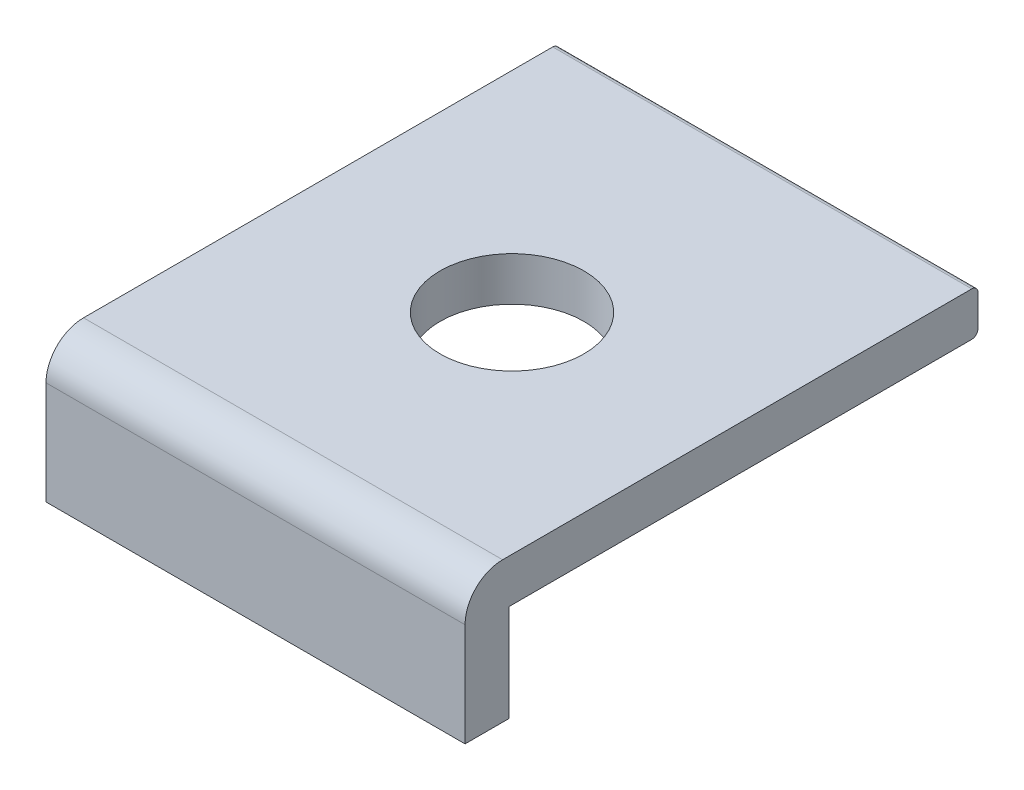
ISO-10303-21;
HEADER;
FILE_DESCRIPTION(('STEP AP214'),'2;1');
FILE_NAME('part.step','',(''),(''),'','','');
FILE_SCHEMA(('AUTOMOTIVE_DESIGN { 1 0 10303 214 1 1 1 1 }'));
ENDSEC;
DATA;
#1=APPLICATION_CONTEXT('core data for automotive mechanical design processes');
#2=APPLICATION_PROTOCOL_DEFINITION('international standard','automotive_design',2000,#1);
#3=PRODUCT_CONTEXT('',#1,'mechanical');
#4=PRODUCT('Part','Part','',(#3));
#5=PRODUCT_RELATED_PRODUCT_CATEGORY('part','',(#4));
#6=PRODUCT_DEFINITION_FORMATION('','',#4);
#7=PRODUCT_DEFINITION_CONTEXT('part definition',#1,'design');
#8=PRODUCT_DEFINITION('design','',#6,#7);
#9=PRODUCT_DEFINITION_SHAPE('','',#8);
#10=(LENGTH_UNIT() NAMED_UNIT(*) SI_UNIT(.MILLI.,.METRE.));
#11=(NAMED_UNIT(*) PLANE_ANGLE_UNIT() SI_UNIT($,.RADIAN.));
#12=(NAMED_UNIT(*) SI_UNIT($,.STERADIAN.) SOLID_ANGLE_UNIT());
#13=UNCERTAINTY_MEASURE_WITH_UNIT(LENGTH_MEASURE(1.E-05),#10,'distance_accuracy_value','');
#14=(GEOMETRIC_REPRESENTATION_CONTEXT(3) GLOBAL_UNCERTAINTY_ASSIGNED_CONTEXT((#13)) GLOBAL_UNIT_ASSIGNED_CONTEXT((#10,
#11,#12)) REPRESENTATION_CONTEXT('',''));
#15=CARTESIAN_POINT('',(0.,0.,0.));
#16=DIRECTION('',(0.,0.,1.));
#17=DIRECTION('',(1.,0.,0.));
#18=AXIS2_PLACEMENT_3D('',#15,#16,#17);
#19=CARTESIAN_POINT('',(6.7,0.,0.));
#20=DIRECTION('',(0.,1.,0.));
#21=DIRECTION('',(0.,0.,1.));
#22=AXIS2_PLACEMENT_3D('',#19,#20,#21);
#23=PLANE('',#22);
#24=DIRECTION('',(0.,0.,-1.));
#25=VECTOR('',#24,1.);
#26=CARTESIAN_POINT('',(0.,0.,0.));
#27=LINE('',#26,#25);
#28=CARTESIAN_POINT('',(0.,0.,0.));
#29=VERTEX_POINT('',#28);
#30=CARTESIAN_POINT('',(0.,0.,-0.7));
#31=VERTEX_POINT('',#30);
#32=EDGE_CURVE('E136',#29,#31,#27,.T.);
#33=ORIENTED_EDGE('',*,*,#32,.T.);
#34=DIRECTION('',(-1.,0.,0.));
#35=VECTOR('',#34,1.);
#36=CARTESIAN_POINT('',(6.7,0.,-0.7));
#37=LINE('',#36,#35);
#38=CARTESIAN_POINT('',(6.7,0.,-0.7));
#39=VERTEX_POINT('',#38);
#40=EDGE_CURVE('E11',#39,#31,#37,.T.);
#41=ORIENTED_EDGE('',*,*,#40,.F.);
#42=DIRECTION('',(0.,0.,-1.));
#43=VECTOR('',#42,1.);
#44=CARTESIAN_POINT('',(6.7,0.,0.));
#45=LINE('',#44,#43);
#46=CARTESIAN_POINT('',(6.7,0.,0.));
#47=VERTEX_POINT('',#46);
#48=EDGE_CURVE('E153',#47,#39,#45,.T.);
#49=ORIENTED_EDGE('',*,*,#48,.F.);
#50=DIRECTION('',(-1.,0.,0.));
#51=VECTOR('',#50,1.);
#52=CARTESIAN_POINT('',(6.7,0.,0.));
#53=LINE('',#52,#51);
#54=EDGE_CURVE('E132',#47,#29,#53,.T.);
#55=ORIENTED_EDGE('',*,*,#54,.T.);
#56=EDGE_LOOP('',(#33,#41,#49,#55));
#57=FACE_BOUND('',#56,.T.);
#58=ADVANCED_FACE('F34',(#57),#23,.F.);
#59=CARTESIAN_POINT('',(6.7,0.,-0.7));
#60=DIRECTION('',(0.,0.,1.));
#61=DIRECTION('',(1.,0.,0.));
#62=AXIS2_PLACEMENT_3D('',#59,#60,#61);
#63=PLANE('',#62);
#64=DIRECTION('',(0.,1.,0.));
#65=VECTOR('',#64,1.);
#66=CARTESIAN_POINT('',(0.,0.,-0.7));
#67=LINE('',#66,#65);
#68=CARTESIAN_POINT('',(0.,1.55,-0.7));
#69=VERTEX_POINT('',#68);
#70=EDGE_CURVE('E139',#31,#69,#67,.T.);
#71=ORIENTED_EDGE('',*,*,#70,.T.);
#72=DIRECTION('',(-1.,0.,0.));
#73=VECTOR('',#72,1.);
#74=CARTESIAN_POINT('',(6.7,1.55,-0.7));
#75=LINE('',#74,#73);
#76=CARTESIAN_POINT('',(6.7,1.55,-0.7));
#77=VERTEX_POINT('',#76);
#78=EDGE_CURVE('E42',#77,#69,#75,.T.);
#79=ORIENTED_EDGE('',*,*,#78,.F.);
#80=DIRECTION('',(0.,1.,0.));
#81=VECTOR('',#80,1.);
#82=CARTESIAN_POINT('',(6.7,0.,-0.7));
#83=LINE('',#82,#81);
#84=EDGE_CURVE('E96',#39,#77,#83,.T.);
#85=ORIENTED_EDGE('',*,*,#84,.F.);
#86=ORIENTED_EDGE('',*,*,#40,.T.);
#87=EDGE_LOOP('',(#71,#79,#85,#86));
#88=FACE_BOUND('',#87,.T.);
#89=ADVANCED_FACE('F215',(#88),#63,.F.);
#90=CARTESIAN_POINT('',(6.7,1.55,-0.7));
#91=DIRECTION('',(0.,1.,0.));
#92=DIRECTION('',(0.,0.,1.));
#93=AXIS2_PLACEMENT_3D('',#90,#91,#92);
#94=PLANE('',#93);
#95=CARTESIAN_POINT('',(3.35,1.55,-4.1005));
#96=DIRECTION('',(0.,1.,0.));
#97=DIRECTION('',(0.,0.,1.));
#98=AXIS2_PLACEMENT_3D('',#95,#96,#97);
#99=CIRCLE('',#98,1.15);
#100=CARTESIAN_POINT('',(3.35,1.55,-2.9505));
#101=VERTEX_POINT('',#100);
#102=EDGE_CURVE('E140',#101,#101,#99,.T.);
#103=ORIENTED_EDGE('',*,*,#102,.T.);
#104=EDGE_LOOP('',(#103));
#105=FACE_BOUND('',#104,.T.);
#106=DIRECTION('',(0.,0.,-1.));
#107=VECTOR('',#106,1.);
#108=CARTESIAN_POINT('',(0.,1.55,-0.7));
#109=LINE('',#108,#107);
#110=CARTESIAN_POINT('',(0.,1.55,-8.101));
#111=VERTEX_POINT('',#110);
#112=EDGE_CURVE('E142',#69,#111,#109,.T.);
#113=ORIENTED_EDGE('',*,*,#112,.T.);
#114=DIRECTION('',(-1.,0.,0.));
#115=VECTOR('',#114,1.);
#116=CARTESIAN_POINT('',(6.7,1.55,-8.101));
#117=LINE('',#116,#115);
#118=CARTESIAN_POINT('',(6.7,1.55,-8.101));
#119=VERTEX_POINT('',#118);
#120=EDGE_CURVE('E163',#119,#111,#117,.T.);
#121=ORIENTED_EDGE('',*,*,#120,.F.);
#122=DIRECTION('',(0.,0.,-1.));
#123=VECTOR('',#122,1.);
#124=CARTESIAN_POINT('',(6.7,1.55,-0.7));
#125=LINE('',#124,#123);
#126=EDGE_CURVE('E171',#77,#119,#125,.T.);
#127=ORIENTED_EDGE('',*,*,#126,.F.);
#128=ORIENTED_EDGE('',*,*,#78,.T.);
#129=EDGE_LOOP('',(#113,#121,#127,#128));
#130=FACE_BOUND('',#129,.T.);
#131=ADVANCED_FACE('F169',(#105,#130),#94,.F.);
#132=CARTESIAN_POINT('',(6.7,1.65,-8.101));
#133=DIRECTION('',(-1.,0.,0.));
#134=DIRECTION('',(0.,0.,1.));
#135=AXIS2_PLACEMENT_3D('',#132,#133,#134);
#136=CYLINDRICAL_SURFACE('',#135,0.0999999999999997);
#137=CARTESIAN_POINT('',(0.,1.65,-8.101));
#138=DIRECTION('',(1.,0.,0.));
#139=DIRECTION('',(0.,0.,1.));
#140=AXIS2_PLACEMENT_3D('',#137,#138,#139);
#141=CIRCLE('',#140,0.0999999999999997);
#142=CARTESIAN_POINT('',(0.,1.65,-8.201));
#143=VERTEX_POINT('',#142);
#144=EDGE_CURVE('E144',#111,#143,#141,.T.);
#145=ORIENTED_EDGE('',*,*,#144,.T.);
#146=DIRECTION('',(-1.,0.,0.));
#147=VECTOR('',#146,1.);
#148=CARTESIAN_POINT('',(6.7,1.65,-8.201));
#149=LINE('',#148,#147);
#150=CARTESIAN_POINT('',(6.7,1.65,-8.201));
#151=VERTEX_POINT('',#150);
#152=EDGE_CURVE('E160',#151,#143,#149,.T.);
#153=ORIENTED_EDGE('',*,*,#152,.F.);
#154=CARTESIAN_POINT('',(6.7,1.65,-8.101));
#155=DIRECTION('',(1.,0.,0.));
#156=DIRECTION('',(0.,0.,1.));
#157=AXIS2_PLACEMENT_3D('',#154,#155,#156);
#158=CIRCLE('',#157,0.0999999999999997);
#159=EDGE_CURVE('E187',#119,#151,#158,.T.);
#160=ORIENTED_EDGE('',*,*,#159,.F.);
#161=ORIENTED_EDGE('',*,*,#120,.T.);
#162=EDGE_LOOP('',(#145,#153,#160,#161));
#163=FACE_BOUND('',#162,.T.);
#164=ADVANCED_FACE('F180',(#163),#136,.T.);
#165=CARTESIAN_POINT('',(6.7,2.15,-8.201));
#166=DIRECTION('',(0.,0.,1.));
#167=DIRECTION('',(1.,0.,0.));
#168=AXIS2_PLACEMENT_3D('',#165,#166,#167);
#169=PLANE('',#168);
#170=DIRECTION('',(0.,1.,0.));
#171=VECTOR('',#170,1.);
#172=CARTESIAN_POINT('',(0.,2.15,-8.201));
#173=LINE('',#172,#171);
#174=CARTESIAN_POINT('',(0.,2.15,-8.201));
#175=VERTEX_POINT('',#174);
#176=EDGE_CURVE('E146',#143,#175,#173,.T.);
#177=ORIENTED_EDGE('',*,*,#176,.T.);
#178=DIRECTION('',(-1.,0.,0.));
#179=VECTOR('',#178,1.);
#180=CARTESIAN_POINT('',(6.7,2.15,-8.201));
#181=LINE('',#180,#179);
#182=CARTESIAN_POINT('',(6.7,2.15,-8.201));
#183=VERTEX_POINT('',#182);
#184=EDGE_CURVE('E157',#183,#175,#181,.T.);
#185=ORIENTED_EDGE('',*,*,#184,.F.);
#186=DIRECTION('',(0.,1.,0.));
#187=VECTOR('',#186,1.);
#188=CARTESIAN_POINT('',(6.7,2.15,-8.201));
#189=LINE('',#188,#187);
#190=EDGE_CURVE('E186',#151,#183,#189,.T.);
#191=ORIENTED_EDGE('',*,*,#190,.F.);
#192=ORIENTED_EDGE('',*,*,#152,.T.);
#193=EDGE_LOOP('',(#177,#185,#191,#192));
#194=FACE_BOUND('',#193,.T.);
#195=ADVANCED_FACE('F184',(#194),#169,.F.);
#196=CARTESIAN_POINT('',(6.7,2.15,-8.101));
#197=DIRECTION('',(-1.,0.,0.));
#198=DIRECTION('',(0.,0.,1.));
#199=AXIS2_PLACEMENT_3D('',#196,#197,#198);
#200=CYLINDRICAL_SURFACE('',#199,0.0999999999999996);
#201=CARTESIAN_POINT('',(0.,2.15,-8.101));
#202=DIRECTION('',(1.,0.,0.));
#203=DIRECTION('',(0.,0.,-1.));
#204=AXIS2_PLACEMENT_3D('',#201,#202,#203);
#205=CIRCLE('',#204,0.0999999999999996);
#206=CARTESIAN_POINT('',(0.,2.25,-8.101));
#207=VERTEX_POINT('',#206);
#208=EDGE_CURVE('E148',#175,#207,#205,.T.);
#209=ORIENTED_EDGE('',*,*,#208,.T.);
#210=DIRECTION('',(-1.,0.,0.));
#211=VECTOR('',#210,1.);
#212=CARTESIAN_POINT('',(6.7,2.25,-8.101));
#213=LINE('',#212,#211);
#214=CARTESIAN_POINT('',(6.7,2.25,-8.101));
#215=VERTEX_POINT('',#214);
#216=EDGE_CURVE('E127',#215,#207,#213,.T.);
#217=ORIENTED_EDGE('',*,*,#216,.F.);
#218=CARTESIAN_POINT('',(6.7,2.15,-8.101));
#219=DIRECTION('',(1.,0.,0.));
#220=DIRECTION('',(0.,0.,-1.));
#221=AXIS2_PLACEMENT_3D('',#218,#219,#220);
#222=CIRCLE('',#221,0.0999999999999996);
#223=EDGE_CURVE('E118',#183,#215,#222,.T.);
#224=ORIENTED_EDGE('',*,*,#223,.F.);
#225=ORIENTED_EDGE('',*,*,#184,.T.);
#226=EDGE_LOOP('',(#209,#217,#224,#225));
#227=FACE_BOUND('',#226,.T.);
#228=ADVANCED_FACE('F204',(#227),#200,.T.);
#229=CARTESIAN_POINT('',(6.7,2.25,-0.600000000000004));
#230=DIRECTION('',(0.,-1.,0.));
#231=DIRECTION('',(0.,0.,-1.));
#232=AXIS2_PLACEMENT_3D('',#229,#230,#231);
#233=PLANE('',#232);
#234=CARTESIAN_POINT('',(3.35,2.25,-4.1005));
#235=DIRECTION('',(0.,1.,0.));
#236=DIRECTION('',(0.,0.,1.));
#237=AXIS2_PLACEMENT_3D('',#234,#235,#236);
#238=CIRCLE('',#237,1.15);
#239=CARTESIAN_POINT('',(3.35,2.25,-2.9505));
#240=VERTEX_POINT('',#239);
#241=EDGE_CURVE('E196',#240,#240,#238,.T.);
#242=ORIENTED_EDGE('',*,*,#241,.F.);
#243=EDGE_LOOP('',(#242));
#244=FACE_BOUND('',#243,.T.);
#245=DIRECTION('',(0.,0.,1.));
#246=VECTOR('',#245,1.);
#247=CARTESIAN_POINT('',(0.,2.25,-0.600000000000004));
#248=LINE('',#247,#246);
#249=CARTESIAN_POINT('',(0.,2.25,-0.600000000000004));
#250=VERTEX_POINT('',#249);
#251=EDGE_CURVE('E126',#207,#250,#248,.T.);
#252=ORIENTED_EDGE('',*,*,#251,.T.);
#253=DIRECTION('',(-1.,0.,0.));
#254=VECTOR('',#253,1.);
#255=CARTESIAN_POINT('',(6.7,2.25,-0.600000000000004));
#256=LINE('',#255,#254);
#257=CARTESIAN_POINT('',(6.7,2.25,-0.600000000000004));
#258=VERTEX_POINT('',#257);
#259=EDGE_CURVE('E123',#258,#250,#256,.T.);
#260=ORIENTED_EDGE('',*,*,#259,.F.);
#261=DIRECTION('',(0.,0.,1.));
#262=VECTOR('',#261,1.);
#263=CARTESIAN_POINT('',(6.7,2.25,-0.600000000000004));
#264=LINE('',#263,#262);
#265=EDGE_CURVE('E112',#215,#258,#264,.T.);
#266=ORIENTED_EDGE('',*,*,#265,.F.);
#267=ORIENTED_EDGE('',*,*,#216,.T.);
#268=EDGE_LOOP('',(#252,#260,#266,#267));
#269=FACE_BOUND('',#268,.T.);
#270=ADVANCED_FACE('F124',(#244,#269),#233,.F.);
#271=CARTESIAN_POINT('',(6.7,1.65,-0.6));
#272=DIRECTION('',(-1.,0.,0.));
#273=DIRECTION('',(0.,0.,1.));
#274=AXIS2_PLACEMENT_3D('',#271,#272,#273);
#275=CYLINDRICAL_SURFACE('',#274,0.6);
#276=CARTESIAN_POINT('',(0.,1.65,-0.6));
#277=DIRECTION('',(1.,0.,0.));
#278=DIRECTION('',(0.,0.,1.));
#279=AXIS2_PLACEMENT_3D('',#276,#277,#278);
#280=CIRCLE('',#279,0.6);
#281=CARTESIAN_POINT('',(0.,1.65,0.));
#282=VERTEX_POINT('',#281);
#283=EDGE_CURVE('E82',#250,#282,#280,.T.);
#284=ORIENTED_EDGE('',*,*,#283,.T.);
#285=DIRECTION('',(-1.,0.,0.));
#286=VECTOR('',#285,1.);
#287=CARTESIAN_POINT('',(6.7,1.65,0.));
#288=LINE('',#287,#286);
#289=CARTESIAN_POINT('',(6.7,1.65,0.));
#290=VERTEX_POINT('',#289);
#291=EDGE_CURVE('E128',#290,#282,#288,.T.);
#292=ORIENTED_EDGE('',*,*,#291,.F.);
#293=CARTESIAN_POINT('',(6.7,1.65,-0.6));
#294=DIRECTION('',(1.,0.,0.));
#295=DIRECTION('',(0.,0.,1.));
#296=AXIS2_PLACEMENT_3D('',#293,#294,#295);
#297=CIRCLE('',#296,0.6);
#298=EDGE_CURVE('E116',#258,#290,#297,.T.);
#299=ORIENTED_EDGE('',*,*,#298,.F.);
#300=ORIENTED_EDGE('',*,*,#259,.T.);
#301=EDGE_LOOP('',(#284,#292,#299,#300));
#302=FACE_BOUND('',#301,.T.);
#303=ADVANCED_FACE('F130',(#302),#275,.T.);
#304=CARTESIAN_POINT('',(6.7,0.,0.));
#305=DIRECTION('',(0.,0.,-1.));
#306=DIRECTION('',(-1.,0.,0.));
#307=AXIS2_PLACEMENT_3D('',#304,#305,#306);
#308=PLANE('',#307);
#309=DIRECTION('',(0.,-1.,0.));
#310=VECTOR('',#309,1.);
#311=CARTESIAN_POINT('',(0.,0.,0.));
#312=LINE('',#311,#310);
#313=EDGE_CURVE('E88',#282,#29,#312,.T.);
#314=ORIENTED_EDGE('',*,*,#313,.T.);
#315=ORIENTED_EDGE('',*,*,#54,.F.);
#316=DIRECTION('',(0.,-1.,0.));
#317=VECTOR('',#316,1.);
#318=CARTESIAN_POINT('',(6.7,0.,0.));
#319=LINE('',#318,#317);
#320=EDGE_CURVE('E50',#290,#47,#319,.T.);
#321=ORIENTED_EDGE('',*,*,#320,.F.);
#322=ORIENTED_EDGE('',*,*,#291,.T.);
#323=EDGE_LOOP('',(#314,#315,#321,#322));
#324=FACE_BOUND('',#323,.T.);
#325=ADVANCED_FACE('F210',(#324),#308,.F.);
#326=CARTESIAN_POINT('',(6.7,1.65,-8.101));
#327=DIRECTION('',(-1.,0.,0.));
#328=DIRECTION('',(0.,0.,1.));
#329=AXIS2_PLACEMENT_3D('',#326,#327,#328);
#330=PLANE('',#329);
#331=ORIENTED_EDGE('',*,*,#48,.T.);
#332=ORIENTED_EDGE('',*,*,#84,.T.);
#333=ORIENTED_EDGE('',*,*,#126,.T.);
#334=ORIENTED_EDGE('',*,*,#159,.T.);
#335=ORIENTED_EDGE('',*,*,#190,.T.);
#336=ORIENTED_EDGE('',*,*,#223,.T.);
#337=ORIENTED_EDGE('',*,*,#265,.T.);
#338=ORIENTED_EDGE('',*,*,#298,.T.);
#339=ORIENTED_EDGE('',*,*,#320,.T.);
#340=EDGE_LOOP('',(#331,#332,#333,#334,#335,#336,#337,#338,#339));
#341=FACE_BOUND('',#340,.T.);
#342=ADVANCED_FACE('F114',(#341),#330,.F.);
#343=CARTESIAN_POINT('',(0.,1.65,-8.101));
#344=DIRECTION('',(-1.,0.,0.));
#345=DIRECTION('',(0.,0.,1.));
#346=AXIS2_PLACEMENT_3D('',#343,#344,#345);
#347=PLANE('',#346);
#348=ORIENTED_EDGE('',*,*,#32,.F.);
#349=ORIENTED_EDGE('',*,*,#313,.F.);
#350=ORIENTED_EDGE('',*,*,#283,.F.);
#351=ORIENTED_EDGE('',*,*,#251,.F.);
#352=ORIENTED_EDGE('',*,*,#208,.F.);
#353=ORIENTED_EDGE('',*,*,#176,.F.);
#354=ORIENTED_EDGE('',*,*,#144,.F.);
#355=ORIENTED_EDGE('',*,*,#112,.F.);
#356=ORIENTED_EDGE('',*,*,#70,.F.);
#357=EDGE_LOOP('',(#348,#349,#350,#351,#352,#353,#354,#355,#356));
#358=FACE_BOUND('',#357,.T.);
#359=ADVANCED_FACE('F175',(#358),#347,.T.);
#360=CARTESIAN_POINT('',(3.35,-4.45,-4.1005));
#361=DIRECTION('',(0.,1.,0.));
#362=DIRECTION('',(0.,0.,1.));
#363=AXIS2_PLACEMENT_3D('',#360,#361,#362);
#364=CYLINDRICAL_SURFACE('',#363,1.15);
#365=ORIENTED_EDGE('',*,*,#241,.T.);
#366=EDGE_LOOP('',(#365));
#367=FACE_BOUND('',#366,.T.);
#368=ORIENTED_EDGE('',*,*,#102,.F.);
#369=EDGE_LOOP('',(#368));
#370=FACE_BOUND('',#369,.T.);
#371=ADVANCED_FACE('F200',(#367,#370),#364,.F.);
#372=CLOSED_SHELL('',(#58,#89,#131,#164,#195,#228,#270,#303,#325,#342,#359,#371));
#373=MANIFOLD_SOLID_BREP('B2',#372);
#374=ADVANCED_BREP_SHAPE_REPRESENTATION('',(#18,#373),#14);
#375=SHAPE_DEFINITION_REPRESENTATION(#9,#374);
ENDSEC;
END-ISO-10303-21;
